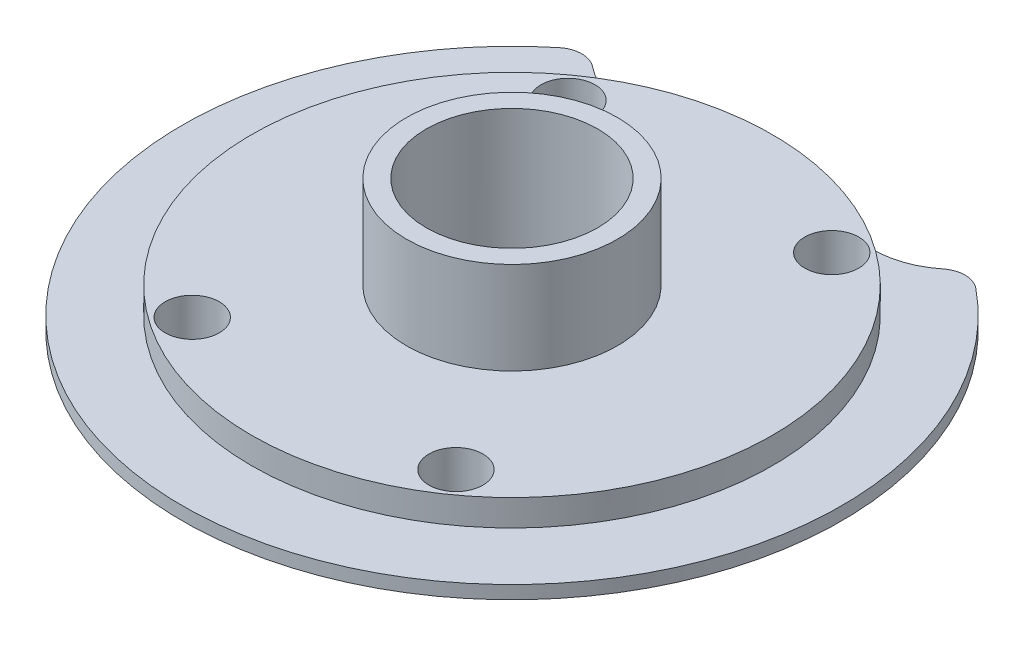
ISO-10303-21;
HEADER;
FILE_DESCRIPTION(('STEP AP214'),'2;1');
FILE_NAME('part.step','',(''),(''),'','','');
FILE_SCHEMA(('AUTOMOTIVE_DESIGN { 1 0 10303 214 1 1 1 1 }'));
ENDSEC;
DATA;
#1=APPLICATION_CONTEXT('core data for automotive mechanical design processes');
#2=APPLICATION_PROTOCOL_DEFINITION('international standard','automotive_design',2000,#1);
#3=PRODUCT_CONTEXT('',#1,'mechanical');
#4=PRODUCT('Part','Part','',(#3));
#5=PRODUCT_RELATED_PRODUCT_CATEGORY('part','',(#4));
#6=PRODUCT_DEFINITION_FORMATION('','',#4);
#7=PRODUCT_DEFINITION_CONTEXT('part definition',#1,'design');
#8=PRODUCT_DEFINITION('design','',#6,#7);
#9=PRODUCT_DEFINITION_SHAPE('','',#8);
#10=(LENGTH_UNIT() NAMED_UNIT(*) SI_UNIT(.MILLI.,.METRE.));
#11=(NAMED_UNIT(*) PLANE_ANGLE_UNIT() SI_UNIT($,.RADIAN.));
#12=(NAMED_UNIT(*) SI_UNIT($,.STERADIAN.) SOLID_ANGLE_UNIT());
#13=UNCERTAINTY_MEASURE_WITH_UNIT(LENGTH_MEASURE(1.E-05),#10,'distance_accuracy_value','');
#14=(GEOMETRIC_REPRESENTATION_CONTEXT(3) GLOBAL_UNCERTAINTY_ASSIGNED_CONTEXT((#13)) GLOBAL_UNIT_ASSIGNED_CONTEXT((#10,
#11,#12)) REPRESENTATION_CONTEXT('',''));
#15=CARTESIAN_POINT('',(0.,0.,0.));
#16=DIRECTION('',(0.,0.,1.));
#17=DIRECTION('',(1.,0.,0.));
#18=AXIS2_PLACEMENT_3D('',#15,#16,#17);
#19=CARTESIAN_POINT('',(0.,1.5,0.));
#20=DIRECTION('',(0.,1.,0.));
#21=DIRECTION('',(0.,0.,1.));
#22=AXIS2_PLACEMENT_3D('',#19,#20,#21);
#23=PLANE('',#22);
#24=CARTESIAN_POINT('',(5.,1.5,7.125));
#25=DIRECTION('',(0.,1.,0.));
#26=DIRECTION('',(0.,0.,1.));
#27=AXIS2_PLACEMENT_3D('',#24,#25,#26);
#28=CIRCLE('',#27,1.025);
#29=CARTESIAN_POINT('',(5.,1.5,8.15));
#30=VERTEX_POINT('',#29);
#31=EDGE_CURVE('E255',#30,#30,#28,.F.);
#32=ORIENTED_EDGE('',*,*,#31,.T.);
#33=EDGE_LOOP('',(#32));
#34=FACE_BOUND('',#33,.T.);
#35=CARTESIAN_POINT('',(-5.,1.5,7.125));
#36=DIRECTION('',(0.,1.,0.));
#37=DIRECTION('',(0.,0.,1.));
#38=AXIS2_PLACEMENT_3D('',#35,#36,#37);
#39=CIRCLE('',#38,1.025);
#40=CARTESIAN_POINT('',(-5.,1.5,8.15));
#41=VERTEX_POINT('',#40);
#42=EDGE_CURVE('E259',#41,#41,#39,.T.);
#43=ORIENTED_EDGE('',*,*,#42,.F.);
#44=EDGE_LOOP('',(#43));
#45=FACE_BOUND('',#44,.T.);
#46=CARTESIAN_POINT('',(0.,1.5,0.));
#47=DIRECTION('',(0.,1.,0.));
#48=DIRECTION('',(0.,0.,1.));
#49=AXIS2_PLACEMENT_3D('',#46,#47,#48);
#50=CIRCLE('',#49,4.);
#51=CARTESIAN_POINT('',(0.,1.5,4.));
#52=VERTEX_POINT('',#51);
#53=EDGE_CURVE('E166',#52,#52,#50,.T.);
#54=ORIENTED_EDGE('',*,*,#53,.F.);
#55=EDGE_LOOP('',(#54));
#56=FACE_BOUND('',#55,.T.);
#57=CARTESIAN_POINT('',(0.,1.5,0.));
#58=DIRECTION('',(0.,1.,0.));
#59=DIRECTION('',(0.,0.,1.));
#60=AXIS2_PLACEMENT_3D('',#57,#58,#59);
#61=CIRCLE('',#60,9.875);
#62=CARTESIAN_POINT('',(0.,1.5,9.875));
#63=VERTEX_POINT('',#62);
#64=EDGE_CURVE('E127',#63,#63,#61,.T.);
#65=ORIENTED_EDGE('',*,*,#64,.T.);
#66=EDGE_LOOP('',(#65));
#67=FACE_BOUND('',#66,.T.);
#68=CARTESIAN_POINT('',(5.,1.5,-7.125));
#69=DIRECTION('',(0.,1.,0.));
#70=DIRECTION('',(0.,0.,1.));
#71=AXIS2_PLACEMENT_3D('',#68,#69,#70);
#72=CIRCLE('',#71,1.025);
#73=CARTESIAN_POINT('',(5.,1.5,-6.1));
#74=VERTEX_POINT('',#73);
#75=EDGE_CURVE('E251',#74,#74,#72,.T.);
#76=ORIENTED_EDGE('',*,*,#75,.F.);
#77=EDGE_LOOP('',(#76));
#78=FACE_BOUND('',#77,.T.);
#79=CARTESIAN_POINT('',(-5.,1.5,-7.125));
#80=DIRECTION('',(0.,1.,0.));
#81=DIRECTION('',(0.,0.,1.));
#82=AXIS2_PLACEMENT_3D('',#79,#80,#81);
#83=CIRCLE('',#82,1.025);
#84=CARTESIAN_POINT('',(-5.,1.5,-6.1));
#85=VERTEX_POINT('',#84);
#86=EDGE_CURVE('E128',#85,#85,#83,.F.);
#87=ORIENTED_EDGE('',*,*,#86,.T.);
#88=EDGE_LOOP('',(#87));
#89=FACE_BOUND('',#88,.T.);
#90=ADVANCED_FACE('F52',(#34,#45,#56,#67,#78,#89),#23,.T.);
#91=CARTESIAN_POINT('',(0.,0.,0.));
#92=DIRECTION('',(0.,1.,0.));
#93=DIRECTION('',(0.,0.,1.));
#94=AXIS2_PLACEMENT_3D('',#91,#92,#93);
#95=PLANE('',#94);
#96=CARTESIAN_POINT('',(5.,0.,-7.125));
#97=DIRECTION('',(0.,-1.,0.));
#98=DIRECTION('',(0.,0.,-1.));
#99=AXIS2_PLACEMENT_3D('',#96,#97,#98);
#100=CIRCLE('',#99,1.025);
#101=CARTESIAN_POINT('',(5.,0.,-8.15));
#102=VERTEX_POINT('',#101);
#103=EDGE_CURVE('E269',#102,#102,#100,.T.);
#104=ORIENTED_EDGE('',*,*,#103,.F.);
#105=EDGE_LOOP('',(#104));
#106=FACE_BOUND('',#105,.T.);
#107=CARTESIAN_POINT('',(-5.,0.,7.125));
#108=DIRECTION('',(0.,-1.,0.));
#109=DIRECTION('',(0.,0.,-1.));
#110=AXIS2_PLACEMENT_3D('',#107,#108,#109);
#111=CIRCLE('',#110,1.025);
#112=CARTESIAN_POINT('',(-5.,0.,6.1));
#113=VERTEX_POINT('',#112);
#114=EDGE_CURVE('E262',#113,#113,#111,.T.);
#115=ORIENTED_EDGE('',*,*,#114,.F.);
#116=EDGE_LOOP('',(#115));
#117=FACE_BOUND('',#116,.T.);
#118=CARTESIAN_POINT('',(0.,0.,0.));
#119=DIRECTION('',(0.,-1.,0.));
#120=DIRECTION('',(0.,0.,-1.));
#121=AXIS2_PLACEMENT_3D('',#118,#119,#120);
#122=CIRCLE('',#121,3.25);
#123=CARTESIAN_POINT('',(0.,0.,-3.25));
#124=VERTEX_POINT('',#123);
#125=EDGE_CURVE('E175',#124,#124,#122,.T.);
#126=ORIENTED_EDGE('',*,*,#125,.F.);
#127=EDGE_LOOP('',(#126));
#128=FACE_BOUND('',#127,.T.);
#129=CARTESIAN_POINT('',(0.,0.,0.));
#130=DIRECTION('',(0.,1.,0.));
#131=DIRECTION('',(0.,0.,1.));
#132=AXIS2_PLACEMENT_3D('',#129,#130,#131);
#133=CIRCLE('',#132,12.5);
#134=CARTESIAN_POINT('',(-7.89740650092125,0.,-9.68921929565055));
#135=VERTEX_POINT('',#134);
#136=CARTESIAN_POINT('',(7.89740650092124,0.,-9.68921929565055));
#137=VERTEX_POINT('',#136);
#138=EDGE_CURVE('E135',#135,#137,#133,.T.);
#139=ORIENTED_EDGE('',*,*,#138,.F.);
#140=CARTESIAN_POINT('',(-7.26561398084755,0.,-8.9140817519985));
#141=DIRECTION('',(0.,1.,0.));
#142=DIRECTION('',(0.,0.,1.));
#143=AXIS2_PLACEMENT_3D('',#140,#141,#142);
#144=CIRCLE('',#143,1.);
#145=CARTESIAN_POINT('',(-6.63884559828866,0.,-9.69328736967878));
#146=VERTEX_POINT('',#145);
#147=EDGE_CURVE('E60',#135,#146,#144,.F.);
#148=ORIENTED_EDGE('',*,*,#147,.T.);
#149=CARTESIAN_POINT('',(-4.68019440279212,0.,-12.1283049249297));
#150=DIRECTION('',(0.,1.,0.));
#151=DIRECTION('',(0.,0.,1.));
#152=AXIS2_PLACEMENT_3D('',#149,#150,#151);
#153=CIRCLE('',#152,3.125);
#154=CARTESIAN_POINT('',(-3.55514767135171,0.,-9.21284701028311));
#155=VERTEX_POINT('',#154);
#156=EDGE_CURVE('E105',#146,#155,#153,.T.);
#157=ORIENTED_EDGE('',*,*,#156,.T.);
#158=CARTESIAN_POINT('',(0.,0.,0.));
#159=DIRECTION('',(0.,1.,0.));
#160=DIRECTION('',(0.,0.,1.));
#161=AXIS2_PLACEMENT_3D('',#158,#159,#160);
#162=CIRCLE('',#161,9.875);
#163=CARTESIAN_POINT('',(3.55514767135171,0.,-9.21284701028311));
#164=VERTEX_POINT('',#163);
#165=EDGE_CURVE('E109',#155,#164,#162,.F.);
#166=ORIENTED_EDGE('',*,*,#165,.T.);
#167=CARTESIAN_POINT('',(4.68019440279212,0.,-12.1283049249297));
#168=DIRECTION('',(0.,1.,0.));
#169=DIRECTION('',(0.,0.,1.));
#170=AXIS2_PLACEMENT_3D('',#167,#168,#169);
#171=CIRCLE('',#170,3.125);
#172=CARTESIAN_POINT('',(6.63884559828866,0.,-9.69328736967878));
#173=VERTEX_POINT('',#172);
#174=EDGE_CURVE('E140',#164,#173,#171,.T.);
#175=ORIENTED_EDGE('',*,*,#174,.T.);
#176=CARTESIAN_POINT('',(7.26561398084754,0.,-8.9140817519985));
#177=DIRECTION('',(0.,1.,0.));
#178=DIRECTION('',(0.,0.,1.));
#179=AXIS2_PLACEMENT_3D('',#176,#177,#178);
#180=CIRCLE('',#179,1.);
#181=EDGE_CURVE('E72',#173,#137,#180,.F.);
#182=ORIENTED_EDGE('',*,*,#181,.T.);
#183=EDGE_LOOP('',(#139,#148,#157,#166,#175,#182));
#184=FACE_BOUND('',#183,.T.);
#185=CARTESIAN_POINT('',(5.,0.,7.125));
#186=DIRECTION('',(0.,-1.,0.));
#187=DIRECTION('',(0.,0.,-1.));
#188=AXIS2_PLACEMENT_3D('',#185,#186,#187);
#189=CIRCLE('',#188,1.025);
#190=CARTESIAN_POINT('',(5.,0.,6.1));
#191=VERTEX_POINT('',#190);
#192=EDGE_CURVE('E265',#191,#191,#189,.F.);
#193=ORIENTED_EDGE('',*,*,#192,.T.);
#194=EDGE_LOOP('',(#193));
#195=FACE_BOUND('',#194,.T.);
#196=CARTESIAN_POINT('',(-5.,0.,-7.125));
#197=DIRECTION('',(0.,-1.,0.));
#198=DIRECTION('',(0.,0.,-1.));
#199=AXIS2_PLACEMENT_3D('',#196,#197,#198);
#200=CIRCLE('',#199,1.025);
#201=CARTESIAN_POINT('',(-5.,0.,-8.15));
#202=VERTEX_POINT('',#201);
#203=EDGE_CURVE('E266',#202,#202,#200,.F.);
#204=ORIENTED_EDGE('',*,*,#203,.T.);
#205=EDGE_LOOP('',(#204));
#206=FACE_BOUND('',#205,.T.);
#207=ADVANCED_FACE('F107',(#106,#117,#128,#184,#195,#206),#95,.F.);
#208=CARTESIAN_POINT('',(0.,1.5,0.));
#209=DIRECTION('',(0.,-1.,0.));
#210=DIRECTION('',(0.,0.,-1.));
#211=AXIS2_PLACEMENT_3D('',#208,#209,#210);
#212=CYLINDRICAL_SURFACE('',#211,12.5);
#213=CARTESIAN_POINT('',(0.,0.5,0.));
#214=DIRECTION('',(0.,1.,0.));
#215=DIRECTION('',(0.,0.,1.));
#216=AXIS2_PLACEMENT_3D('',#213,#214,#215);
#217=CIRCLE('',#216,12.5);
#218=CARTESIAN_POINT('',(-7.89740650092125,0.5,-9.68921929565055));
#219=VERTEX_POINT('',#218);
#220=CARTESIAN_POINT('',(7.89740650092124,0.5,-9.68921929565055));
#221=VERTEX_POINT('',#220);
#222=EDGE_CURVE('E161',#219,#221,#217,.T.);
#223=ORIENTED_EDGE('',*,*,#222,.F.);
#224=DIRECTION('',(0.,-1.,0.));
#225=VECTOR('',#224,1.);
#226=CARTESIAN_POINT('',(-7.89740650092125,1.5,-9.68921929565055));
#227=LINE('',#226,#225);
#228=EDGE_CURVE('E189',#219,#135,#227,.T.);
#229=ORIENTED_EDGE('',*,*,#228,.T.);
#230=ORIENTED_EDGE('',*,*,#138,.T.);
#231=DIRECTION('',(0.,-1.,0.));
#232=VECTOR('',#231,1.);
#233=CARTESIAN_POINT('',(7.89740650092124,1.5,-9.68921929565055));
#234=LINE('',#233,#232);
#235=EDGE_CURVE('E187',#137,#221,#234,.F.);
#236=ORIENTED_EDGE('',*,*,#235,.T.);
#237=EDGE_LOOP('',(#223,#229,#230,#236));
#238=FACE_BOUND('',#237,.T.);
#239=ADVANCED_FACE('F186',(#238),#212,.T.);
#240=CARTESIAN_POINT('',(0.,1.5,0.));
#241=DIRECTION('',(0.,-1.,0.));
#242=DIRECTION('',(0.,0.,-1.));
#243=AXIS2_PLACEMENT_3D('',#240,#241,#242);
#244=CYLINDRICAL_SURFACE('',#243,3.25);
#245=ORIENTED_EDGE('',*,*,#125,.T.);
#246=EDGE_LOOP('',(#245));
#247=FACE_BOUND('',#246,.T.);
#248=CARTESIAN_POINT('',(0.,5.,0.));
#249=DIRECTION('',(0.,1.,0.));
#250=DIRECTION('',(0.,0.,1.));
#251=AXIS2_PLACEMENT_3D('',#248,#249,#250);
#252=CIRCLE('',#251,3.25);
#253=CARTESIAN_POINT('',(0.,5.,3.25));
#254=VERTEX_POINT('',#253);
#255=EDGE_CURVE('E170',#254,#254,#252,.F.);
#256=ORIENTED_EDGE('',*,*,#255,.F.);
#257=EDGE_LOOP('',(#256));
#258=FACE_BOUND('',#257,.T.);
#259=ADVANCED_FACE('F220',(#247,#258),#244,.F.);
#260=CARTESIAN_POINT('',(0.,5.,0.));
#261=DIRECTION('',(0.,-1.,0.));
#262=DIRECTION('',(0.,0.,-1.));
#263=AXIS2_PLACEMENT_3D('',#260,#261,#262);
#264=CYLINDRICAL_SURFACE('',#263,4.);
#265=CARTESIAN_POINT('',(0.,5.,0.));
#266=DIRECTION('',(0.,1.,0.));
#267=DIRECTION('',(0.,0.,1.));
#268=AXIS2_PLACEMENT_3D('',#265,#266,#267);
#269=CIRCLE('',#268,4.);
#270=CARTESIAN_POINT('',(0.,5.,4.));
#271=VERTEX_POINT('',#270);
#272=EDGE_CURVE('E173',#271,#271,#269,.T.);
#273=ORIENTED_EDGE('',*,*,#272,.F.);
#274=EDGE_LOOP('',(#273));
#275=FACE_BOUND('',#274,.T.);
#276=ORIENTED_EDGE('',*,*,#53,.T.);
#277=EDGE_LOOP('',(#276));
#278=FACE_BOUND('',#277,.T.);
#279=ADVANCED_FACE('F227',(#275,#278),#264,.T.);
#280=CARTESIAN_POINT('',(0.,5.,0.));
#281=DIRECTION('',(0.,1.,0.));
#282=DIRECTION('',(0.,0.,1.));
#283=AXIS2_PLACEMENT_3D('',#280,#281,#282);
#284=PLANE('',#283);
#285=ORIENTED_EDGE('',*,*,#255,.T.);
#286=EDGE_LOOP('',(#285));
#287=FACE_BOUND('',#286,.T.);
#288=ORIENTED_EDGE('',*,*,#272,.T.);
#289=EDGE_LOOP('',(#288));
#290=FACE_BOUND('',#289,.T.);
#291=ADVANCED_FACE('F232',(#287,#290),#284,.T.);
#292=CARTESIAN_POINT('',(0.,0.5,0.));
#293=DIRECTION('',(0.,1.,0.));
#294=DIRECTION('',(0.,0.,1.));
#295=AXIS2_PLACEMENT_3D('',#292,#293,#294);
#296=CYLINDRICAL_SURFACE('',#295,9.875);
#297=ORIENTED_EDGE('',*,*,#165,.F.);
#298=DIRECTION('',(0.,1.,0.));
#299=VECTOR('',#298,1.);
#300=CARTESIAN_POINT('',(-3.55514767135171,0.5,-9.21284701028311));
#301=LINE('',#300,#299);
#302=CARTESIAN_POINT('',(-3.55514767135171,0.5,-9.21284701028311));
#303=VERTEX_POINT('',#302);
#304=EDGE_CURVE('E123',#155,#303,#301,.T.);
#305=ORIENTED_EDGE('',*,*,#304,.T.);
#306=CARTESIAN_POINT('',(0.,0.5,0.));
#307=DIRECTION('',(0.,1.,0.));
#308=DIRECTION('',(0.,0.,1.));
#309=AXIS2_PLACEMENT_3D('',#306,#307,#308);
#310=CIRCLE('',#309,9.875);
#311=CARTESIAN_POINT('',(3.55514767135171,0.5,-9.21284701028311));
#312=VERTEX_POINT('',#311);
#313=EDGE_CURVE('E157',#303,#312,#310,.T.);
#314=ORIENTED_EDGE('',*,*,#313,.T.);
#315=DIRECTION('',(0.,1.,0.));
#316=VECTOR('',#315,1.);
#317=CARTESIAN_POINT('',(3.55514767135171,0.5,-9.21284701028312));
#318=LINE('',#317,#316);
#319=EDGE_CURVE('E125',#312,#164,#318,.F.);
#320=ORIENTED_EDGE('',*,*,#319,.T.);
#321=EDGE_LOOP('',(#297,#305,#314,#320));
#322=FACE_BOUND('',#321,.T.);
#323=ORIENTED_EDGE('',*,*,#64,.F.);
#324=EDGE_LOOP('',(#323));
#325=FACE_BOUND('',#324,.T.);
#326=ADVANCED_FACE('F120',(#322,#325),#296,.T.);
#327=CARTESIAN_POINT('',(0.,0.5,0.));
#328=DIRECTION('',(0.,1.,0.));
#329=DIRECTION('',(0.,0.,1.));
#330=AXIS2_PLACEMENT_3D('',#327,#328,#329);
#331=PLANE('',#330);
#332=CARTESIAN_POINT('',(-4.68019440279212,0.5,-12.1283049249297));
#333=DIRECTION('',(0.,1.,0.));
#334=DIRECTION('',(0.,0.,1.));
#335=AXIS2_PLACEMENT_3D('',#332,#333,#334);
#336=CIRCLE('',#335,3.125);
#337=CARTESIAN_POINT('',(-6.63884559828866,0.5,-9.69328736967878));
#338=VERTEX_POINT('',#337);
#339=EDGE_CURVE('E116',#303,#338,#336,.F.);
#340=ORIENTED_EDGE('',*,*,#339,.T.);
#341=CARTESIAN_POINT('',(-7.26561398084755,0.5,-8.9140817519985));
#342=DIRECTION('',(0.,1.,0.));
#343=DIRECTION('',(0.,0.,1.));
#344=AXIS2_PLACEMENT_3D('',#341,#342,#343);
#345=CIRCLE('',#344,1.);
#346=EDGE_CURVE('E192',#338,#219,#345,.T.);
#347=ORIENTED_EDGE('',*,*,#346,.T.);
#348=ORIENTED_EDGE('',*,*,#222,.T.);
#349=CARTESIAN_POINT('',(7.26561398084754,0.5,-8.9140817519985));
#350=DIRECTION('',(0.,1.,0.));
#351=DIRECTION('',(0.,0.,1.));
#352=AXIS2_PLACEMENT_3D('',#349,#350,#351);
#353=CIRCLE('',#352,1.);
#354=CARTESIAN_POINT('',(6.63884559828866,0.5,-9.69328736967878));
#355=VERTEX_POINT('',#354);
#356=EDGE_CURVE('E191',#221,#355,#353,.T.);
#357=ORIENTED_EDGE('',*,*,#356,.T.);
#358=CARTESIAN_POINT('',(4.68019440279212,0.5,-12.1283049249297));
#359=DIRECTION('',(0.,1.,0.));
#360=DIRECTION('',(0.,0.,1.));
#361=AXIS2_PLACEMENT_3D('',#358,#359,#360);
#362=CIRCLE('',#361,3.125);
#363=EDGE_CURVE('E115',#355,#312,#362,.F.);
#364=ORIENTED_EDGE('',*,*,#363,.T.);
#365=ORIENTED_EDGE('',*,*,#313,.F.);
#366=EDGE_LOOP('',(#340,#347,#348,#357,#364,#365));
#367=FACE_BOUND('',#366,.T.);
#368=ADVANCED_FACE('F199',(#367),#331,.T.);
#369=CARTESIAN_POINT('',(-4.68019440279212,1.5,-12.1283049249297));
#370=DIRECTION('',(0.,-1.,0.));
#371=DIRECTION('',(0.,0.,-1.));
#372=AXIS2_PLACEMENT_3D('',#369,#370,#371);
#373=CYLINDRICAL_SURFACE('',#372,3.125);
#374=ORIENTED_EDGE('',*,*,#156,.F.);
#375=DIRECTION('',(0.,-1.,0.));
#376=VECTOR('',#375,1.);
#377=CARTESIAN_POINT('',(-6.63884559828866,1.5,-9.69328736967878));
#378=LINE('',#377,#376);
#379=EDGE_CURVE('E144',#146,#338,#378,.F.);
#380=ORIENTED_EDGE('',*,*,#379,.T.);
#381=ORIENTED_EDGE('',*,*,#339,.F.);
#382=ORIENTED_EDGE('',*,*,#304,.F.);
#383=EDGE_LOOP('',(#374,#380,#381,#382));
#384=FACE_BOUND('',#383,.T.);
#385=ADVANCED_FACE('F131',(#384),#373,.F.);
#386=CARTESIAN_POINT('',(4.68019440279212,0.5,-12.1283049249297));
#387=DIRECTION('',(0.,-1.,0.));
#388=DIRECTION('',(0.,0.,-1.));
#389=AXIS2_PLACEMENT_3D('',#386,#387,#388);
#390=CYLINDRICAL_SURFACE('',#389,3.125);
#391=ORIENTED_EDGE('',*,*,#363,.F.);
#392=DIRECTION('',(0.,-1.,0.));
#393=VECTOR('',#392,1.);
#394=CARTESIAN_POINT('',(6.63884559828866,0.5,-9.69328736967878));
#395=LINE('',#394,#393);
#396=EDGE_CURVE('E13',#355,#173,#395,.T.);
#397=ORIENTED_EDGE('',*,*,#396,.T.);
#398=ORIENTED_EDGE('',*,*,#174,.F.);
#399=ORIENTED_EDGE('',*,*,#319,.F.);
#400=EDGE_LOOP('',(#391,#397,#398,#399));
#401=FACE_BOUND('',#400,.T.);
#402=ADVANCED_FACE('F200',(#401),#390,.F.);
#403=CARTESIAN_POINT('',(-7.26561398084755,1.5,-8.9140817519985));
#404=DIRECTION('',(0.,-1.,0.));
#405=DIRECTION('',(0.,0.,-1.));
#406=AXIS2_PLACEMENT_3D('',#403,#404,#405);
#407=CYLINDRICAL_SURFACE('',#406,1.);
#408=ORIENTED_EDGE('',*,*,#147,.F.);
#409=ORIENTED_EDGE('',*,*,#228,.F.);
#410=ORIENTED_EDGE('',*,*,#346,.F.);
#411=ORIENTED_EDGE('',*,*,#379,.F.);
#412=EDGE_LOOP('',(#408,#409,#410,#411));
#413=FACE_BOUND('',#412,.T.);
#414=ADVANCED_FACE('F202',(#413),#407,.T.);
#415=CARTESIAN_POINT('',(7.26561398084754,0.5,-8.9140817519985));
#416=DIRECTION('',(0.,-1.,0.));
#417=DIRECTION('',(0.,0.,-1.));
#418=AXIS2_PLACEMENT_3D('',#415,#416,#417);
#419=CYLINDRICAL_SURFACE('',#418,1.);
#420=ORIENTED_EDGE('',*,*,#181,.F.);
#421=ORIENTED_EDGE('',*,*,#396,.F.);
#422=ORIENTED_EDGE('',*,*,#356,.F.);
#423=ORIENTED_EDGE('',*,*,#235,.F.);
#424=EDGE_LOOP('',(#420,#421,#422,#423));
#425=FACE_BOUND('',#424,.T.);
#426=ADVANCED_FACE('F54',(#425),#419,.T.);
#427=CARTESIAN_POINT('',(-5.,5.,7.125));
#428=DIRECTION('',(0.,-1.,0.));
#429=DIRECTION('',(0.,0.,-1.));
#430=AXIS2_PLACEMENT_3D('',#427,#428,#429);
#431=CYLINDRICAL_SURFACE('',#430,1.025);
#432=ORIENTED_EDGE('',*,*,#42,.T.);
#433=EDGE_LOOP('',(#432));
#434=FACE_BOUND('',#433,.T.);
#435=ORIENTED_EDGE('',*,*,#114,.T.);
#436=EDGE_LOOP('',(#435));
#437=FACE_BOUND('',#436,.T.);
#438=ADVANCED_FACE('F279',(#434,#437),#431,.F.);
#439=CARTESIAN_POINT('',(5.,5.,7.125));
#440=DIRECTION('',(0.,-1.,0.));
#441=DIRECTION('',(0.,0.,-1.));
#442=AXIS2_PLACEMENT_3D('',#439,#440,#441);
#443=CYLINDRICAL_SURFACE('',#442,1.025);
#444=ORIENTED_EDGE('',*,*,#31,.F.);
#445=EDGE_LOOP('',(#444));
#446=FACE_BOUND('',#445,.T.);
#447=ORIENTED_EDGE('',*,*,#192,.F.);
#448=EDGE_LOOP('',(#447));
#449=FACE_BOUND('',#448,.T.);
#450=ADVANCED_FACE('F276',(#446,#449),#443,.F.);
#451=CARTESIAN_POINT('',(5.,5.,-7.125));
#452=DIRECTION('',(0.,-1.,0.));
#453=DIRECTION('',(0.,0.,-1.));
#454=AXIS2_PLACEMENT_3D('',#451,#452,#453);
#455=CYLINDRICAL_SURFACE('',#454,1.025);
#456=ORIENTED_EDGE('',*,*,#75,.T.);
#457=EDGE_LOOP('',(#456));
#458=FACE_BOUND('',#457,.T.);
#459=ORIENTED_EDGE('',*,*,#103,.T.);
#460=EDGE_LOOP('',(#459));
#461=FACE_BOUND('',#460,.T.);
#462=ADVANCED_FACE('F278',(#458,#461),#455,.F.);
#463=CARTESIAN_POINT('',(-5.,5.,-7.125));
#464=DIRECTION('',(0.,-1.,0.));
#465=DIRECTION('',(0.,0.,-1.));
#466=AXIS2_PLACEMENT_3D('',#463,#464,#465);
#467=CYLINDRICAL_SURFACE('',#466,1.025);
#468=ORIENTED_EDGE('',*,*,#86,.F.);
#469=EDGE_LOOP('',(#468));
#470=FACE_BOUND('',#469,.T.);
#471=ORIENTED_EDGE('',*,*,#203,.F.);
#472=EDGE_LOOP('',(#471));
#473=FACE_BOUND('',#472,.T.);
#474=ADVANCED_FACE('F286',(#470,#473),#467,.F.);
#475=CLOSED_SHELL('',(#90,#207,#239,#259,#279,#291,#326,#368,#385,#402,#414,#426,#438,#450,#462,#474));
#476=MANIFOLD_SOLID_BREP('B2',#475);
#477=ADVANCED_BREP_SHAPE_REPRESENTATION('',(#18,#476),#14);
#478=SHAPE_DEFINITION_REPRESENTATION(#9,#477);
ENDSEC;
END-ISO-10303-21;
